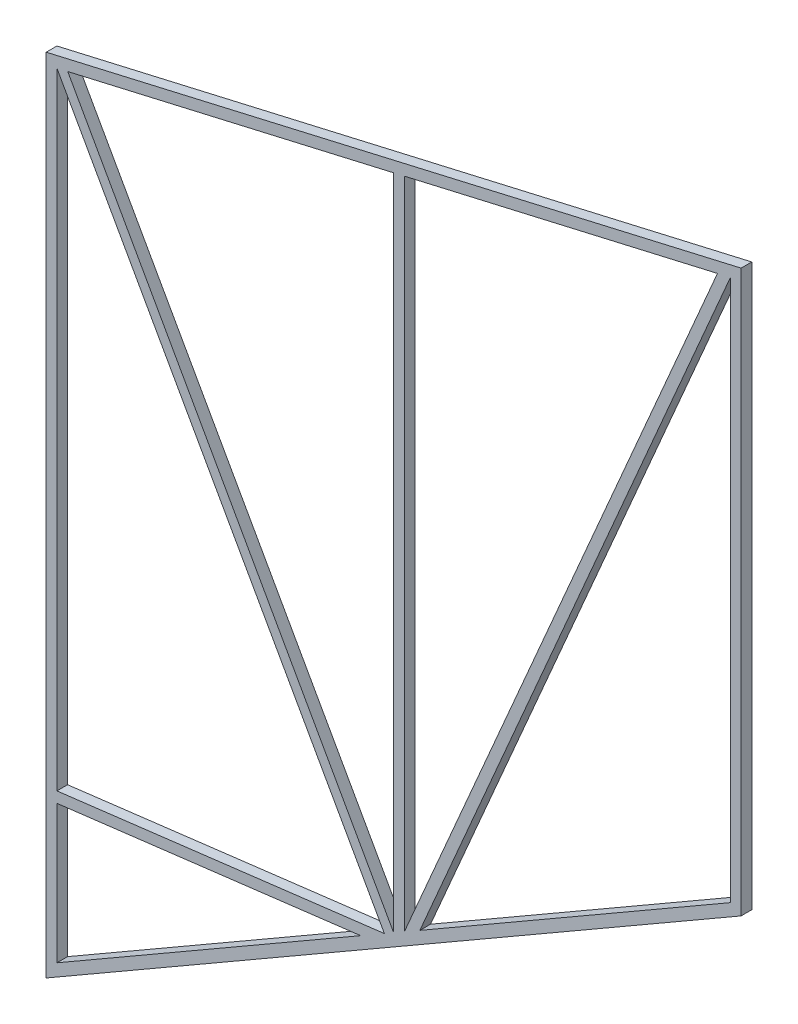
ISO-10303-21;
HEADER;
FILE_DESCRIPTION(('STEP AP214'),'2;1');
FILE_NAME('part.step','',(''),(''),'','','');
FILE_SCHEMA(('AUTOMOTIVE_DESIGN { 1 0 10303 214 1 1 1 1 }'));
ENDSEC;
DATA;
#1=APPLICATION_CONTEXT('core data for automotive mechanical design processes');
#2=APPLICATION_PROTOCOL_DEFINITION('international standard','automotive_design',2000,#1);
#3=PRODUCT_CONTEXT('',#1,'mechanical');
#4=PRODUCT('Part','Part','',(#3));
#5=PRODUCT_RELATED_PRODUCT_CATEGORY('part','',(#4));
#6=PRODUCT_DEFINITION_FORMATION('','',#4);
#7=PRODUCT_DEFINITION_CONTEXT('part definition',#1,'design');
#8=PRODUCT_DEFINITION('design','',#6,#7);
#9=PRODUCT_DEFINITION_SHAPE('','',#8);
#10=(LENGTH_UNIT() NAMED_UNIT(*) SI_UNIT(.MILLI.,.METRE.));
#11=(NAMED_UNIT(*) PLANE_ANGLE_UNIT() SI_UNIT($,.RADIAN.));
#12=(NAMED_UNIT(*) SI_UNIT($,.STERADIAN.) SOLID_ANGLE_UNIT());
#13=UNCERTAINTY_MEASURE_WITH_UNIT(LENGTH_MEASURE(1.E-05),#10,'distance_accuracy_value','');
#14=(GEOMETRIC_REPRESENTATION_CONTEXT(3) GLOBAL_UNCERTAINTY_ASSIGNED_CONTEXT((#13)) GLOBAL_UNIT_ASSIGNED_CONTEXT((#10,
#11,#12)) REPRESENTATION_CONTEXT('',''));
#15=CARTESIAN_POINT('',(0.,0.,0.));
#16=DIRECTION('',(0.,0.,1.));
#17=DIRECTION('',(1.,0.,0.));
#18=AXIS2_PLACEMENT_3D('',#15,#16,#17);
#19=CARTESIAN_POINT('',(-1.,1.73205080756891,2.));
#20=DIRECTION('',(0.499999999999995,-0.866025403784442,0.));
#21=DIRECTION('',(0.866025403784442,0.499999999999995,0.));
#22=AXIS2_PLACEMENT_3D('',#19,#20,#21);
#23=PLANE('',#22);
#24=DIRECTION('',(-0.866025403784442,-0.499999999999995,0.));
#25=VECTOR('',#24,1.);
#26=CARTESIAN_POINT('',(-1.,1.73205080756891,0.));
#27=LINE('',#26,#25);
#28=CARTESIAN_POINT('',(128.,76.2102355330296,0.));
#29=VERTEX_POINT('',#28);
#30=CARTESIAN_POINT('',(69.8990198641382,42.6656190114092,0.));
#31=VERTEX_POINT('',#30);
#32=EDGE_CURVE('E184',#29,#31,#27,.T.);
#33=ORIENTED_EDGE('',*,*,#32,.T.);
#34=DIRECTION('',(0.,0.,-1.));
#35=VECTOR('',#34,1.);
#36=CARTESIAN_POINT('',(69.8990198641382,42.6656190114092,2.));
#37=LINE('',#36,#35);
#38=CARTESIAN_POINT('',(69.8990198641382,42.6656190114092,2.));
#39=VERTEX_POINT('',#38);
#40=EDGE_CURVE('E11',#39,#31,#37,.T.);
#41=ORIENTED_EDGE('',*,*,#40,.F.);
#42=DIRECTION('',(-0.866025403784442,-0.499999999999995,0.));
#43=VECTOR('',#42,1.);
#44=CARTESIAN_POINT('',(-1.,1.73205080756891,2.));
#45=LINE('',#44,#43);
#46=CARTESIAN_POINT('',(128.,76.2102355330296,2.));
#47=VERTEX_POINT('',#46);
#48=EDGE_CURVE('E173',#47,#39,#45,.T.);
#49=ORIENTED_EDGE('',*,*,#48,.F.);
#50=DIRECTION('',(0.,0.,-1.));
#51=VECTOR('',#50,1.);
#52=CARTESIAN_POINT('',(128.,76.2102355330296,2.));
#53=LINE('',#52,#51);
#54=EDGE_CURVE('E241',#47,#29,#53,.T.);
#55=ORIENTED_EDGE('',*,*,#54,.T.);
#56=EDGE_LOOP('',(#33,#41,#49,#55));
#57=FACE_BOUND('',#56,.T.);
#58=ADVANCED_FACE('F38',(#57),#23,.F.);
#59=CARTESIAN_POINT('',(43.4465867926933,-18.7216121069354,2.));
#60=DIRECTION('',(0.918365303491958,-0.395733710141206,0.));
#61=DIRECTION('',(0.395733710141206,0.918365303491958,0.));
#62=AXIS2_PLACEMENT_3D('',#59,#60,#61);
#63=PLANE('',#62);
#64=DIRECTION('',(-0.395733710141206,-0.918365303491958,0.));
#65=VECTOR('',#64,1.);
#66=CARTESIAN_POINT('',(43.4465867926933,-18.7216121069354,0.));
#67=LINE('',#66,#65);
#68=CARTESIAN_POINT('',(128.,177.498520248485,0.));
#69=VERTEX_POINT('',#68);
#70=EDGE_CURVE('E237',#69,#31,#67,.T.);
#71=ORIENTED_EDGE('',*,*,#70,.F.);
#72=DIRECTION('',(0.,0.,-1.));
#73=VECTOR('',#72,1.);
#74=CARTESIAN_POINT('',(128.,177.498520248485,2.));
#75=LINE('',#74,#73);
#76=CARTESIAN_POINT('',(128.,177.498520248485,2.));
#77=VERTEX_POINT('',#76);
#78=EDGE_CURVE('E48',#77,#69,#75,.T.);
#79=ORIENTED_EDGE('',*,*,#78,.F.);
#80=DIRECTION('',(-0.395733710141206,-0.918365303491958,0.));
#81=VECTOR('',#80,1.);
#82=CARTESIAN_POINT('',(43.4465867926933,-18.7216121069354,2.));
#83=LINE('',#82,#81);
#84=EDGE_CURVE('E177',#77,#39,#83,.T.);
#85=ORIENTED_EDGE('',*,*,#84,.T.);
#86=ORIENTED_EDGE('',*,*,#40,.T.);
#87=EDGE_LOOP('',(#71,#79,#85,#86));
#88=FACE_BOUND('',#87,.T.);
#89=ADVANCED_FACE('F188',(#88),#63,.T.);
#90=CARTESIAN_POINT('',(0.,0.,2.));
#91=DIRECTION('',(0.499999999999995,-0.866025403784442,0.));
#92=DIRECTION('',(0.866025403784442,0.499999999999995,0.));
#93=AXIS2_PLACEMENT_3D('',#90,#91,#92);
#94=PLANE('',#93);
#95=DIRECTION('',(-0.866025403784442,-0.499999999999995,0.));
#96=VECTOR('',#95,1.);
#97=CARTESIAN_POINT('',(0.,0.,0.));
#98=LINE('',#97,#96);
#99=CARTESIAN_POINT('',(130.,75.0555349946504,0.));
#100=VERTEX_POINT('',#99);
#101=CARTESIAN_POINT('',(0.,0.,0.));
#102=VERTEX_POINT('',#101);
#103=EDGE_CURVE('E225',#100,#102,#98,.T.);
#104=ORIENTED_EDGE('',*,*,#103,.F.);
#105=DIRECTION('',(0.,0.,-1.));
#106=VECTOR('',#105,1.);
#107=CARTESIAN_POINT('',(130.,75.0555349946504,2.));
#108=LINE('',#107,#106);
#109=CARTESIAN_POINT('',(130.,75.0555349946504,2.));
#110=VERTEX_POINT('',#109);
#111=EDGE_CURVE('E243',#110,#100,#108,.T.);
#112=ORIENTED_EDGE('',*,*,#111,.F.);
#113=DIRECTION('',(-0.866025403784442,-0.499999999999995,0.));
#114=VECTOR('',#113,1.);
#115=CARTESIAN_POINT('',(0.,0.,2.));
#116=LINE('',#115,#114);
#117=CARTESIAN_POINT('',(0.,0.,2.));
#118=VERTEX_POINT('',#117);
#119=EDGE_CURVE('E313',#110,#118,#116,.T.);
#120=ORIENTED_EDGE('',*,*,#119,.T.);
#121=DIRECTION('',(0.,0.,-1.));
#122=VECTOR('',#121,1.);
#123=CARTESIAN_POINT('',(0.,0.,2.));
#124=LINE('',#123,#122);
#125=EDGE_CURVE('E245',#118,#102,#124,.T.);
#126=ORIENTED_EDGE('',*,*,#125,.T.);
#127=EDGE_LOOP('',(#104,#112,#120,#126));
#128=FACE_BOUND('',#127,.T.);
#129=ADVANCED_FACE('F339',(#128),#94,.T.);
#130=CARTESIAN_POINT('',(130.,0.,2.));
#131=DIRECTION('',(1.,0.,0.));
#132=DIRECTION('',(0.,0.,-1.));
#133=AXIS2_PLACEMENT_3D('',#130,#131,#132);
#134=PLANE('',#133);
#135=DIRECTION('',(0.,-1.,0.));
#136=VECTOR('',#135,1.);
#137=CARTESIAN_POINT('',(130.,0.,0.));
#138=LINE('',#137,#136);
#139=CARTESIAN_POINT('',(130.,180.012864846323,0.));
#140=VERTEX_POINT('',#139);
#141=EDGE_CURVE('E228',#140,#100,#138,.T.);
#142=ORIENTED_EDGE('',*,*,#141,.F.);
#143=DIRECTION('',(0.,0.,-1.));
#144=VECTOR('',#143,1.);
#145=CARTESIAN_POINT('',(130.,180.012864846323,2.));
#146=LINE('',#145,#144);
#147=CARTESIAN_POINT('',(130.,180.012864846323,2.));
#148=VERTEX_POINT('',#147);
#149=EDGE_CURVE('E250',#148,#140,#146,.T.);
#150=ORIENTED_EDGE('',*,*,#149,.F.);
#151=DIRECTION('',(0.,-1.,0.));
#152=VECTOR('',#151,1.);
#153=CARTESIAN_POINT('',(130.,0.,2.));
#154=LINE('',#153,#152);
#155=EDGE_CURVE('E316',#148,#110,#154,.T.);
#156=ORIENTED_EDGE('',*,*,#155,.T.);
#157=ORIENTED_EDGE('',*,*,#111,.T.);
#158=EDGE_LOOP('',(#142,#150,#156,#157));
#159=FACE_BOUND('',#158,.T.);
#160=ADVANCED_FACE('F333',(#159),#134,.T.);
#161=CARTESIAN_POINT('',(-32.8778360091809,142.409553472437,2.));
#162=DIRECTION('',(-0.224951054343865,0.974370064785235,0.));
#163=DIRECTION('',(-0.974370064785235,-0.224951054343865,0.));
#164=AXIS2_PLACEMENT_3D('',#161,#162,#163);
#165=PLANE('',#164);
#166=DIRECTION('',(0.974370064785235,0.224951054343865,0.));
#167=VECTOR('',#166,1.);
#168=CARTESIAN_POINT('',(-32.8778360091809,142.409553472437,0.));
#169=LINE('',#168,#167);
#170=CARTESIAN_POINT('',(0.,150.,0.));
#171=VERTEX_POINT('',#170);
#172=EDGE_CURVE('E231',#171,#140,#169,.T.);
#173=ORIENTED_EDGE('',*,*,#172,.F.);
#174=DIRECTION('',(0.,0.,-1.));
#175=VECTOR('',#174,1.);
#176=CARTESIAN_POINT('',(0.,150.,2.));
#177=LINE('',#176,#175);
#178=CARTESIAN_POINT('',(0.,150.,2.));
#179=VERTEX_POINT('',#178);
#180=EDGE_CURVE('E247',#179,#171,#177,.T.);
#181=ORIENTED_EDGE('',*,*,#180,.F.);
#182=DIRECTION('',(0.974370064785235,0.224951054343865,0.));
#183=VECTOR('',#182,1.);
#184=CARTESIAN_POINT('',(-32.8778360091809,142.409553472437,2.));
#185=LINE('',#184,#183);
#186=EDGE_CURVE('E318',#179,#148,#185,.T.);
#187=ORIENTED_EDGE('',*,*,#186,.T.);
#188=ORIENTED_EDGE('',*,*,#149,.T.);
#189=EDGE_LOOP('',(#173,#181,#187,#188));
#190=FACE_BOUND('',#189,.T.);
#191=ADVANCED_FACE('F335',(#190),#165,.T.);
#192=CARTESIAN_POINT('',(-3.51436878490502,28.6222368599273,2.));
#193=DIRECTION('',(-0.121869343405145,0.992546151641322,0.));
#194=DIRECTION('',(-0.992546151641323,-0.121869343405145,0.));
#195=AXIS2_PLACEMENT_3D('',#192,#193,#194);
#196=PLANE('',#195);
#197=DIRECTION('',(0.992546151641323,0.121869343405145,0.));
#198=VECTOR('',#197,1.);
#199=CARTESIAN_POINT('',(-3.51436878490502,28.6222368599273,0.));
#200=LINE('',#199,#198);
#201=CARTESIAN_POINT('',(2.,29.2993162098385,0.));
#202=VERTEX_POINT('',#201);
#203=CARTESIAN_POINT('',(58.8349396439848,36.2777693179681,0.));
#204=VERTEX_POINT('',#203);
#205=EDGE_CURVE('E219',#202,#204,#200,.T.);
#206=ORIENTED_EDGE('',*,*,#205,.T.);
#207=DIRECTION('',(0.,0.,-1.));
#208=VECTOR('',#207,1.);
#209=CARTESIAN_POINT('',(58.8349396439848,36.2777693179681,2.));
#210=LINE('',#209,#208);
#211=CARTESIAN_POINT('',(58.8349396439848,36.2777693179681,2.));
#212=VERTEX_POINT('',#211);
#213=EDGE_CURVE('E248',#212,#204,#210,.T.);
#214=ORIENTED_EDGE('',*,*,#213,.F.);
#215=DIRECTION('',(0.992546151641323,0.121869343405145,0.));
#216=VECTOR('',#215,1.);
#217=CARTESIAN_POINT('',(-3.51436878490502,28.6222368599273,2.));
#218=LINE('',#217,#216);
#219=CARTESIAN_POINT('',(2.,29.2993162098385,2.));
#220=VERTEX_POINT('',#219);
#221=EDGE_CURVE('E309',#220,#212,#218,.T.);
#222=ORIENTED_EDGE('',*,*,#221,.F.);
#223=DIRECTION('',(0.,0.,-1.));
#224=VECTOR('',#223,1.);
#225=CARTESIAN_POINT('',(2.,29.2993162098385,2.));
#226=LINE('',#225,#224);
#227=EDGE_CURVE('E253',#220,#202,#226,.T.);
#228=ORIENTED_EDGE('',*,*,#227,.T.);
#229=EDGE_LOOP('',(#206,#214,#222,#228));
#230=FACE_BOUND('',#229,.T.);
#231=ADVANCED_FACE('F357',(#230),#196,.F.);
#232=CARTESIAN_POINT('',(2.,3.46410161513777,0.));
#233=VERTEX_POINT('',#232);
#234=EDGE_CURVE('E223',#204,#233,#27,.T.);
#235=ORIENTED_EDGE('',*,*,#234,.T.);
#236=DIRECTION('',(0.,0.,-1.));
#237=VECTOR('',#236,1.);
#238=CARTESIAN_POINT('',(2.,3.46410161513777,2.));
#239=LINE('',#238,#237);
#240=CARTESIAN_POINT('',(2.,3.46410161513777,2.));
#241=VERTEX_POINT('',#240);
#242=EDGE_CURVE('E256',#241,#233,#239,.T.);
#243=ORIENTED_EDGE('',*,*,#242,.F.);
#244=EDGE_CURVE('E181',#212,#241,#45,.T.);
#245=ORIENTED_EDGE('',*,*,#244,.F.);
#246=ORIENTED_EDGE('',*,*,#213,.T.);
#247=EDGE_LOOP('',(#235,#243,#245,#246));
#248=FACE_BOUND('',#247,.T.);
#249=ADVANCED_FACE('F351',(#248),#23,.F.);
#250=CARTESIAN_POINT('',(64.7418908265325,36.2007657908487,2.));
#251=DIRECTION('',(0.872820173184965,0.488041950329445,0.));
#252=DIRECTION('',(-0.488041950329445,0.872820173184965,0.));
#253=AXIS2_PLACEMENT_3D('',#250,#251,#252);
#254=PLANE('',#253);
#255=DIRECTION('',(0.488041950329445,-0.872820173184965,0.));
#256=VECTOR('',#255,1.);
#257=CARTESIAN_POINT('',(64.7418908265325,36.2007657908487,0.));
#258=LINE('',#257,#256);
#259=CARTESIAN_POINT('',(1.99999999999999,148.409128166664,0.));
#260=VERTEX_POINT('',#259);
#261=CARTESIAN_POINT('',(63.2677853562415,38.8370739832155,0.));
#262=VERTEX_POINT('',#261);
#263=EDGE_CURVE('E211',#260,#262,#258,.T.);
#264=ORIENTED_EDGE('',*,*,#263,.T.);
#265=DIRECTION('',(0.,0.,-1.));
#266=VECTOR('',#265,1.);
#267=CARTESIAN_POINT('',(63.2677853562415,38.8370739832155,2.));
#268=LINE('',#267,#266);
#269=CARTESIAN_POINT('',(63.2677853562415,38.8370739832155,2.));
#270=VERTEX_POINT('',#269);
#271=EDGE_CURVE('E257',#270,#262,#268,.T.);
#272=ORIENTED_EDGE('',*,*,#271,.F.);
#273=DIRECTION('',(0.488041950329445,-0.872820173184965,0.));
#274=VECTOR('',#273,1.);
#275=CARTESIAN_POINT('',(64.7418908265325,36.2007657908487,2.));
#276=LINE('',#275,#274);
#277=CARTESIAN_POINT('',(1.99999999999999,148.409128166664,2.));
#278=VERTEX_POINT('',#277);
#279=EDGE_CURVE('E302',#278,#270,#276,.T.);
#280=ORIENTED_EDGE('',*,*,#279,.F.);
#281=DIRECTION('',(0.,0.,-1.));
#282=VECTOR('',#281,1.);
#283=CARTESIAN_POINT('',(1.99999999999999,148.409128166664,2.));
#284=LINE('',#283,#282);
#285=EDGE_CURVE('E262',#278,#260,#284,.T.);
#286=ORIENTED_EDGE('',*,*,#285,.T.);
#287=EDGE_LOOP('',(#264,#272,#280,#286));
#288=FACE_BOUND('',#287,.T.);
#289=ADVANCED_FACE('F356',(#288),#254,.F.);
#290=CARTESIAN_POINT('',(-3.7581074717153,30.6073291632099,2.));
#291=DIRECTION('',(-0.121869343405144,0.992546151641323,0.));
#292=DIRECTION('',(-0.992546151641323,-0.121869343405144,0.));
#293=AXIS2_PLACEMENT_3D('',#290,#291,#292);
#294=PLANE('',#293);
#295=DIRECTION('',(0.992546151641322,0.121869343405144,0.));
#296=VECTOR('',#295,1.);
#297=CARTESIAN_POINT('',(-3.7581074717153,30.6073291632099,0.));
#298=LINE('',#297,#296);
#299=CARTESIAN_POINT('',(2.,31.3143358607562,0.));
#300=VERTEX_POINT('',#299);
#301=EDGE_CURVE('E214',#300,#262,#298,.T.);
#302=ORIENTED_EDGE('',*,*,#301,.F.);
#303=DIRECTION('',(0.,0.,-1.));
#304=VECTOR('',#303,1.);
#305=CARTESIAN_POINT('',(2.,31.3143358607562,2.));
#306=LINE('',#305,#304);
#307=CARTESIAN_POINT('',(2.,31.3143358607562,2.));
#308=VERTEX_POINT('',#307);
#309=EDGE_CURVE('E265',#308,#300,#306,.T.);
#310=ORIENTED_EDGE('',*,*,#309,.F.);
#311=DIRECTION('',(0.992546151641322,0.121869343405144,0.));
#312=VECTOR('',#311,1.);
#313=CARTESIAN_POINT('',(-3.7581074717153,30.6073291632099,2.));
#314=LINE('',#313,#312);
#315=EDGE_CURVE('E304',#308,#270,#314,.T.);
#316=ORIENTED_EDGE('',*,*,#315,.T.);
#317=ORIENTED_EDGE('',*,*,#271,.T.);
#318=EDGE_LOOP('',(#302,#310,#316,#317));
#319=FACE_BOUND('',#318,.T.);
#320=ADVANCED_FACE('F363',(#319),#294,.T.);
#321=CARTESIAN_POINT('',(65.,0.,2.));
#322=DIRECTION('',(1.,0.,0.));
#323=DIRECTION('',(0.,1.,0.));
#324=AXIS2_PLACEMENT_3D('',#321,#322,#323);
#325=PLANE('',#324);
#326=DIRECTION('',(0.,-1.,0.));
#327=VECTOR('',#326,1.);
#328=CARTESIAN_POINT('',(65.,0.,0.));
#329=LINE('',#328,#327);
#330=CARTESIAN_POINT('',(65.,162.953824207575,0.));
#331=VERTEX_POINT('',#330);
#332=CARTESIAN_POINT('',(65.,39.8371685740837,0.));
#333=VERTEX_POINT('',#332);
#334=EDGE_CURVE('E204',#331,#333,#329,.T.);
#335=ORIENTED_EDGE('',*,*,#334,.T.);
#336=DIRECTION('',(0.,0.,-1.));
#337=VECTOR('',#336,1.);
#338=CARTESIAN_POINT('',(65.,39.8371685740837,2.));
#339=LINE('',#338,#337);
#340=CARTESIAN_POINT('',(65.,39.8371685740837,2.));
#341=VERTEX_POINT('',#340);
#342=EDGE_CURVE('E266',#341,#333,#339,.T.);
#343=ORIENTED_EDGE('',*,*,#342,.F.);
#344=DIRECTION('',(0.,-1.,0.));
#345=VECTOR('',#344,1.);
#346=CARTESIAN_POINT('',(65.,0.,2.));
#347=LINE('',#346,#345);
#348=CARTESIAN_POINT('',(65.,162.953824207575,2.));
#349=VERTEX_POINT('',#348);
#350=EDGE_CURVE('E296',#349,#341,#347,.T.);
#351=ORIENTED_EDGE('',*,*,#350,.F.);
#352=DIRECTION('',(0.,0.,-1.));
#353=VECTOR('',#352,1.);
#354=CARTESIAN_POINT('',(65.,162.953824207575,2.));
#355=LINE('',#354,#353);
#356=EDGE_CURVE('E269',#349,#331,#355,.T.);
#357=ORIENTED_EDGE('',*,*,#356,.T.);
#358=EDGE_LOOP('',(#335,#343,#351,#357));
#359=FACE_BOUND('',#358,.T.);
#360=ADVANCED_FACE('F415',(#359),#325,.F.);
#361=CARTESIAN_POINT('',(66.4875311729024,37.1768496915076,2.));
#362=DIRECTION('',(0.872820173184965,0.488041950329445,0.));
#363=DIRECTION('',(-0.488041950329445,0.872820173184965,0.));
#364=AXIS2_PLACEMENT_3D('',#361,#362,#363);
#365=PLANE('',#364);
#366=DIRECTION('',(0.488041950329445,-0.872820173184964,0.));
#367=VECTOR('',#366,1.);
#368=CARTESIAN_POINT('',(66.4875311729024,37.1768496915076,0.));
#369=LINE('',#368,#367);
#370=CARTESIAN_POINT('',(4.02943999940583,148.877661308325,0.));
#371=VERTEX_POINT('',#370);
#372=EDGE_CURVE('E208',#371,#333,#369,.T.);
#373=ORIENTED_EDGE('',*,*,#372,.F.);
#374=DIRECTION('',(0.,0.,-1.));
#375=VECTOR('',#374,1.);
#376=CARTESIAN_POINT('',(4.02943999940583,148.877661308325,2.));
#377=LINE('',#376,#375);
#378=CARTESIAN_POINT('',(4.02943999940583,148.877661308325,2.));
#379=VERTEX_POINT('',#378);
#380=EDGE_CURVE('E272',#379,#371,#377,.T.);
#381=ORIENTED_EDGE('',*,*,#380,.F.);
#382=DIRECTION('',(0.488041950329445,-0.872820173184964,0.));
#383=VECTOR('',#382,1.);
#384=CARTESIAN_POINT('',(66.4875311729024,37.1768496915076,2.));
#385=LINE('',#384,#383);
#386=EDGE_CURVE('E299',#379,#341,#385,.T.);
#387=ORIENTED_EDGE('',*,*,#386,.T.);
#388=ORIENTED_EDGE('',*,*,#342,.T.);
#389=EDGE_LOOP('',(#373,#381,#387,#388));
#390=FACE_BOUND('',#389,.T.);
#391=ADVANCED_FACE('F417',(#390),#365,.T.);
#392=CARTESIAN_POINT('',(41.6098561857094,-17.930144686653,2.));
#393=DIRECTION('',(-0.918365303491958,0.395733710141206,0.));
#394=DIRECTION('',(-0.395733710141206,-0.918365303491958,0.));
#395=AXIS2_PLACEMENT_3D('',#392,#393,#394);
#396=PLANE('',#395);
#397=DIRECTION('',(0.395733710141206,0.918365303491958,0.));
#398=VECTOR('',#397,1.);
#399=CARTESIAN_POINT('',(41.6098561857094,-17.930144686653,0.));
#400=LINE('',#399,#398);
#401=CARTESIAN_POINT('',(67.,40.9918691124629,0.));
#402=VERTEX_POINT('',#401);
#403=CARTESIAN_POINT('',(125.581629021882,176.940195315297,0.));
#404=VERTEX_POINT('',#403);
#405=EDGE_CURVE('E195',#402,#404,#400,.T.);
#406=ORIENTED_EDGE('',*,*,#405,.F.);
#407=DIRECTION('',(0.,0.,-1.));
#408=VECTOR('',#407,1.);
#409=CARTESIAN_POINT('',(67.,40.9918691124629,2.));
#410=LINE('',#409,#408);
#411=CARTESIAN_POINT('',(67.,40.9918691124629,2.));
#412=VERTEX_POINT('',#411);
#413=EDGE_CURVE('E42',#412,#402,#410,.T.);
#414=ORIENTED_EDGE('',*,*,#413,.F.);
#415=DIRECTION('',(0.395733710141206,0.918365303491958,0.));
#416=VECTOR('',#415,1.);
#417=CARTESIAN_POINT('',(41.6098561857094,-17.930144686653,2.));
#418=LINE('',#417,#416);
#419=CARTESIAN_POINT('',(125.581629021882,176.940195315297,2.));
#420=VERTEX_POINT('',#419);
#421=EDGE_CURVE('E240',#412,#420,#418,.T.);
#422=ORIENTED_EDGE('',*,*,#421,.T.);
#423=DIRECTION('',(0.,0.,-1.));
#424=VECTOR('',#423,1.);
#425=CARTESIAN_POINT('',(125.581629021882,176.940195315297,2.));
#426=LINE('',#425,#424);
#427=EDGE_CURVE('E190',#420,#404,#426,.T.);
#428=ORIENTED_EDGE('',*,*,#427,.T.);
#429=EDGE_LOOP('',(#406,#414,#422,#428));
#430=FACE_BOUND('',#429,.T.);
#431=ADVANCED_FACE('F40',(#430),#396,.T.);
#432=CARTESIAN_POINT('',(67.,0.,2.));
#433=DIRECTION('',(1.,0.,0.));
#434=DIRECTION('',(0.,1.,0.));
#435=AXIS2_PLACEMENT_3D('',#432,#433,#434);
#436=PLANE('',#435);
#437=DIRECTION('',(0.,-1.,0.));
#438=VECTOR('',#437,1.);
#439=CARTESIAN_POINT('',(67.,0.,0.));
#440=LINE('',#439,#438);
#441=CARTESIAN_POINT('',(67.,163.415560589826,0.));
#442=VERTEX_POINT('',#441);
#443=EDGE_CURVE('E198',#442,#402,#440,.T.);
#444=ORIENTED_EDGE('',*,*,#443,.F.);
#445=DIRECTION('',(0.,0.,-1.));
#446=VECTOR('',#445,1.);
#447=CARTESIAN_POINT('',(67.,163.415560589826,2.));
#448=LINE('',#447,#446);
#449=CARTESIAN_POINT('',(67.,163.415560589826,2.));
#450=VERTEX_POINT('',#449);
#451=EDGE_CURVE('E275',#450,#442,#448,.T.);
#452=ORIENTED_EDGE('',*,*,#451,.F.);
#453=DIRECTION('',(0.,-1.,0.));
#454=VECTOR('',#453,1.);
#455=CARTESIAN_POINT('',(67.,0.,2.));
#456=LINE('',#455,#454);
#457=EDGE_CURVE('E284',#450,#412,#456,.T.);
#458=ORIENTED_EDGE('',*,*,#457,.T.);
#459=ORIENTED_EDGE('',*,*,#413,.T.);
#460=EDGE_LOOP('',(#444,#452,#458,#459));
#461=FACE_BOUND('',#460,.T.);
#462=ADVANCED_FACE('F282',(#461),#436,.T.);
#463=CARTESIAN_POINT('',(0.,0.,2.));
#464=DIRECTION('',(-1.,0.,0.));
#465=DIRECTION('',(0.,0.,1.));
#466=AXIS2_PLACEMENT_3D('',#463,#464,#465);
#467=PLANE('',#466);
#468=DIRECTION('',(0.,1.,0.));
#469=VECTOR('',#468,1.);
#470=CARTESIAN_POINT('',(0.,0.,0.));
#471=LINE('',#470,#469);
#472=EDGE_CURVE('E234',#102,#171,#471,.T.);
#473=ORIENTED_EDGE('',*,*,#472,.F.);
#474=ORIENTED_EDGE('',*,*,#125,.F.);
#475=DIRECTION('',(0.,1.,0.));
#476=VECTOR('',#475,1.);
#477=CARTESIAN_POINT('',(0.,0.,2.));
#478=LINE('',#477,#476);
#479=EDGE_CURVE('E179',#118,#179,#478,.T.);
#480=ORIENTED_EDGE('',*,*,#479,.T.);
#481=ORIENTED_EDGE('',*,*,#180,.T.);
#482=EDGE_LOOP('',(#473,#474,#480,#481));
#483=FACE_BOUND('',#482,.T.);
#484=ADVANCED_FACE('F326',(#483),#467,.T.);
#485=CARTESIAN_POINT('',(2.,0.,2.));
#486=DIRECTION('',(-1.,0.,0.));
#487=DIRECTION('',(0.,0.,1.));
#488=AXIS2_PLACEMENT_3D('',#485,#486,#487);
#489=PLANE('',#488);
#490=DIRECTION('',(0.,1.,0.));
#491=VECTOR('',#490,1.);
#492=CARTESIAN_POINT('',(2.,0.,0.));
#493=LINE('',#492,#491);
#494=EDGE_CURVE('E220',#233,#202,#493,.T.);
#495=ORIENTED_EDGE('',*,*,#494,.T.);
#496=ORIENTED_EDGE('',*,*,#227,.F.);
#497=DIRECTION('',(0.,1.,0.));
#498=VECTOR('',#497,1.);
#499=CARTESIAN_POINT('',(2.,0.,2.));
#500=LINE('',#499,#498);
#501=EDGE_CURVE('E310',#241,#220,#500,.T.);
#502=ORIENTED_EDGE('',*,*,#501,.F.);
#503=ORIENTED_EDGE('',*,*,#242,.T.);
#504=EDGE_LOOP('',(#495,#496,#502,#503));
#505=FACE_BOUND('',#504,.T.);
#506=ADVANCED_FACE('F375',(#505),#489,.F.);
#507=EDGE_CURVE('E217',#300,#260,#493,.T.);
#508=ORIENTED_EDGE('',*,*,#507,.T.);
#509=ORIENTED_EDGE('',*,*,#285,.F.);
#510=EDGE_CURVE('E307',#308,#278,#500,.T.);
#511=ORIENTED_EDGE('',*,*,#510,.F.);
#512=ORIENTED_EDGE('',*,*,#309,.T.);
#513=EDGE_LOOP('',(#508,#509,#511,#512));
#514=FACE_BOUND('',#513,.T.);
#515=ADVANCED_FACE('F403',(#514),#489,.F.);
#516=CARTESIAN_POINT('',(-32.4279339004931,140.460813342867,2.));
#517=DIRECTION('',(-0.224951054343865,0.974370064785235,0.));
#518=DIRECTION('',(-0.974370064785235,-0.224951054343865,0.));
#519=AXIS2_PLACEMENT_3D('',#516,#517,#518);
#520=PLANE('',#519);
#521=DIRECTION('',(0.974370064785235,0.224951054343865,0.));
#522=VECTOR('',#521,1.);
#523=CARTESIAN_POINT('',(-32.4279339004931,140.460813342867,0.));
#524=LINE('',#523,#522);
#525=EDGE_CURVE('E205',#371,#331,#524,.T.);
#526=ORIENTED_EDGE('',*,*,#525,.T.);
#527=ORIENTED_EDGE('',*,*,#356,.F.);
#528=DIRECTION('',(0.974370064785235,0.224951054343865,0.));
#529=VECTOR('',#528,1.);
#530=CARTESIAN_POINT('',(-32.4279339004931,140.460813342867,2.));
#531=LINE('',#530,#529);
#532=EDGE_CURVE('E297',#379,#349,#531,.T.);
#533=ORIENTED_EDGE('',*,*,#532,.F.);
#534=ORIENTED_EDGE('',*,*,#380,.T.);
#535=EDGE_LOOP('',(#526,#527,#533,#534));
#536=FACE_BOUND('',#535,.T.);
#537=ADVANCED_FACE('F406',(#536),#520,.F.);
#538=EDGE_CURVE('E201',#442,#404,#524,.T.);
#539=ORIENTED_EDGE('',*,*,#538,.T.);
#540=ORIENTED_EDGE('',*,*,#427,.F.);
#541=EDGE_CURVE('E290',#450,#420,#531,.T.);
#542=ORIENTED_EDGE('',*,*,#541,.F.);
#543=ORIENTED_EDGE('',*,*,#451,.T.);
#544=EDGE_LOOP('',(#539,#540,#542,#543));
#545=FACE_BOUND('',#544,.T.);
#546=ADVANCED_FACE('F289',(#545),#520,.F.);
#547=CARTESIAN_POINT('',(128.,0.,2.));
#548=DIRECTION('',(1.,0.,0.));
#549=DIRECTION('',(0.,0.,-1.));
#550=AXIS2_PLACEMENT_3D('',#547,#548,#549);
#551=PLANE('',#550);
#552=DIRECTION('',(0.,-1.,0.));
#553=VECTOR('',#552,1.);
#554=CARTESIAN_POINT('',(128.,0.,0.));
#555=LINE('',#554,#553);
#556=EDGE_CURVE('E119',#69,#29,#555,.T.);
#557=ORIENTED_EDGE('',*,*,#556,.T.);
#558=ORIENTED_EDGE('',*,*,#54,.F.);
#559=DIRECTION('',(0.,-1.,0.));
#560=VECTOR('',#559,1.);
#561=CARTESIAN_POINT('',(128.,0.,2.));
#562=LINE('',#561,#560);
#563=EDGE_CURVE('E57',#77,#47,#562,.T.);
#564=ORIENTED_EDGE('',*,*,#563,.F.);
#565=ORIENTED_EDGE('',*,*,#78,.T.);
#566=EDGE_LOOP('',(#557,#558,#564,#565));
#567=FACE_BOUND('',#566,.T.);
#568=ADVANCED_FACE('F380',(#567),#551,.F.);
#569=CARTESIAN_POINT('',(0.,0.,2.));
#570=DIRECTION('',(0.,0.,1.));
#571=DIRECTION('',(1.,0.,0.));
#572=AXIS2_PLACEMENT_3D('',#569,#570,#571);
#573=PLANE('',#572);
#574=ORIENTED_EDGE('',*,*,#421,.F.);
#575=ORIENTED_EDGE('',*,*,#457,.F.);
#576=ORIENTED_EDGE('',*,*,#541,.T.);
#577=EDGE_LOOP('',(#574,#575,#576));
#578=FACE_BOUND('',#577,.T.);
#579=ORIENTED_EDGE('',*,*,#350,.T.);
#580=ORIENTED_EDGE('',*,*,#386,.F.);
#581=ORIENTED_EDGE('',*,*,#532,.T.);
#582=EDGE_LOOP('',(#579,#580,#581));
#583=FACE_BOUND('',#582,.T.);
#584=ORIENTED_EDGE('',*,*,#279,.T.);
#585=ORIENTED_EDGE('',*,*,#315,.F.);
#586=ORIENTED_EDGE('',*,*,#510,.T.);
#587=EDGE_LOOP('',(#584,#585,#586));
#588=FACE_BOUND('',#587,.T.);
#589=ORIENTED_EDGE('',*,*,#221,.T.);
#590=ORIENTED_EDGE('',*,*,#244,.T.);
#591=ORIENTED_EDGE('',*,*,#501,.T.);
#592=EDGE_LOOP('',(#589,#590,#591));
#593=FACE_BOUND('',#592,.T.);
#594=ORIENTED_EDGE('',*,*,#119,.F.);
#595=ORIENTED_EDGE('',*,*,#155,.F.);
#596=ORIENTED_EDGE('',*,*,#186,.F.);
#597=ORIENTED_EDGE('',*,*,#479,.F.);
#598=EDGE_LOOP('',(#594,#595,#596,#597));
#599=FACE_BOUND('',#598,.T.);
#600=ORIENTED_EDGE('',*,*,#48,.T.);
#601=ORIENTED_EDGE('',*,*,#84,.F.);
#602=ORIENTED_EDGE('',*,*,#563,.T.);
#603=EDGE_LOOP('',(#600,#601,#602));
#604=FACE_BOUND('',#603,.T.);
#605=ADVANCED_FACE('F175',(#578,#583,#588,#593,#599,#604),#573,.T.);
#606=CARTESIAN_POINT('',(0.,0.,0.));
#607=DIRECTION('',(0.,0.,1.));
#608=DIRECTION('',(1.,0.,0.));
#609=AXIS2_PLACEMENT_3D('',#606,#607,#608);
#610=PLANE('',#609);
#611=ORIENTED_EDGE('',*,*,#405,.T.);
#612=ORIENTED_EDGE('',*,*,#538,.F.);
#613=ORIENTED_EDGE('',*,*,#443,.T.);
#614=EDGE_LOOP('',(#611,#612,#613));
#615=FACE_BOUND('',#614,.T.);
#616=ORIENTED_EDGE('',*,*,#334,.F.);
#617=ORIENTED_EDGE('',*,*,#525,.F.);
#618=ORIENTED_EDGE('',*,*,#372,.T.);
#619=EDGE_LOOP('',(#616,#617,#618));
#620=FACE_BOUND('',#619,.T.);
#621=ORIENTED_EDGE('',*,*,#263,.F.);
#622=ORIENTED_EDGE('',*,*,#507,.F.);
#623=ORIENTED_EDGE('',*,*,#301,.T.);
#624=EDGE_LOOP('',(#621,#622,#623));
#625=FACE_BOUND('',#624,.T.);
#626=ORIENTED_EDGE('',*,*,#205,.F.);
#627=ORIENTED_EDGE('',*,*,#494,.F.);
#628=ORIENTED_EDGE('',*,*,#234,.F.);
#629=EDGE_LOOP('',(#626,#627,#628));
#630=FACE_BOUND('',#629,.T.);
#631=ORIENTED_EDGE('',*,*,#103,.T.);
#632=ORIENTED_EDGE('',*,*,#472,.T.);
#633=ORIENTED_EDGE('',*,*,#172,.T.);
#634=ORIENTED_EDGE('',*,*,#141,.T.);
#635=EDGE_LOOP('',(#631,#632,#633,#634));
#636=FACE_BOUND('',#635,.T.);
#637=ORIENTED_EDGE('',*,*,#32,.F.);
#638=ORIENTED_EDGE('',*,*,#556,.F.);
#639=ORIENTED_EDGE('',*,*,#70,.T.);
#640=EDGE_LOOP('',(#637,#638,#639));
#641=FACE_BOUND('',#640,.T.);
#642=ADVANCED_FACE('F287',(#615,#620,#625,#630,#636,#641),#610,.F.);
#643=CLOSED_SHELL('',(#58,#89,#129,#160,#191,#231,#249,#289,#320,#360,#391,#431,#462,#484,#506,
#515,#537,#546,#568,#605,#642));
#644=MANIFOLD_SOLID_BREP('B2',#643);
#645=ADVANCED_BREP_SHAPE_REPRESENTATION('',(#18,#644),#14);
#646=SHAPE_DEFINITION_REPRESENTATION(#9,#645);
ENDSEC;
END-ISO-10303-21;
